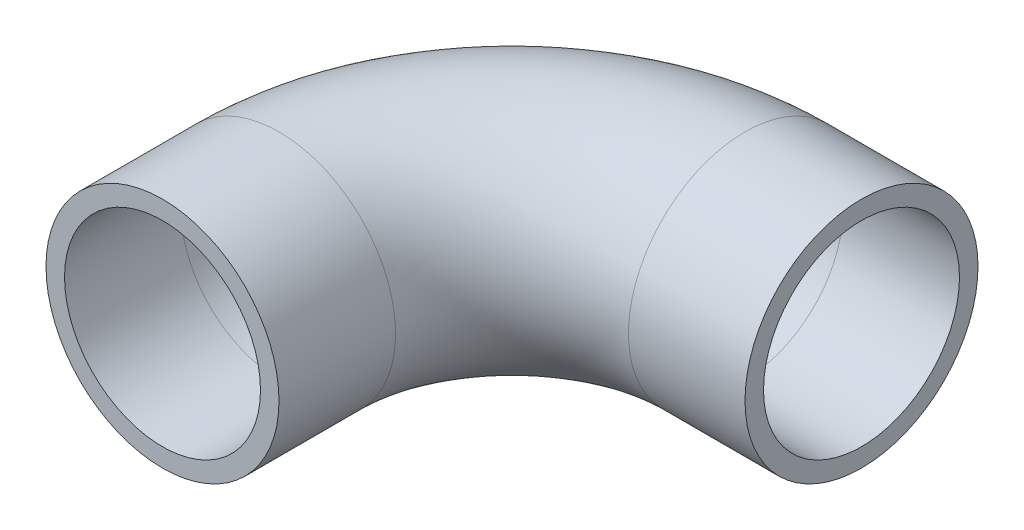
ISO-10303-21;
HEADER;
FILE_DESCRIPTION(('STEP AP214'),'2;1');
FILE_NAME('part.step','',(''),(''),'','','');
FILE_SCHEMA(('AUTOMOTIVE_DESIGN { 1 0 10303 214 1 1 1 1 }'));
ENDSEC;
DATA;
#1=APPLICATION_CONTEXT('core data for automotive mechanical design processes');
#2=APPLICATION_PROTOCOL_DEFINITION('international standard','automotive_design',2000,#1);
#3=PRODUCT_CONTEXT('',#1,'mechanical');
#4=PRODUCT('Part','Part','',(#3));
#5=PRODUCT_RELATED_PRODUCT_CATEGORY('part','',(#4));
#6=PRODUCT_DEFINITION_FORMATION('','',#4);
#7=PRODUCT_DEFINITION_CONTEXT('part definition',#1,'design');
#8=PRODUCT_DEFINITION('design','',#6,#7);
#9=PRODUCT_DEFINITION_SHAPE('','',#8);
#10=(LENGTH_UNIT() NAMED_UNIT(*) SI_UNIT(.MILLI.,.METRE.));
#11=(NAMED_UNIT(*) PLANE_ANGLE_UNIT() SI_UNIT($,.RADIAN.));
#12=(NAMED_UNIT(*) SI_UNIT($,.STERADIAN.) SOLID_ANGLE_UNIT());
#13=UNCERTAINTY_MEASURE_WITH_UNIT(LENGTH_MEASURE(1.E-05),#10,'distance_accuracy_value','');
#14=(GEOMETRIC_REPRESENTATION_CONTEXT(3) GLOBAL_UNCERTAINTY_ASSIGNED_CONTEXT((#13)) GLOBAL_UNIT_ASSIGNED_CONTEXT((#10,
#11,#12)) REPRESENTATION_CONTEXT('',''));
#15=CARTESIAN_POINT('',(0.,0.,0.));
#16=DIRECTION('',(0.,0.,1.));
#17=DIRECTION('',(1.,0.,0.));
#18=AXIS2_PLACEMENT_3D('',#15,#16,#17);
#19=CARTESIAN_POINT('',(0.,0.,0.));
#20=DIRECTION('',(0.,0.,-1.));
#21=DIRECTION('',(-1.,0.,0.));
#22=AXIS2_PLACEMENT_3D('',#19,#20,#21);
#23=CYLINDRICAL_SURFACE('',#22,12.7);
#24=CARTESIAN_POINT('',(0.,0.,-12.7));
#25=DIRECTION('',(0.,0.,1.));
#26=DIRECTION('',(1.,0.,0.));
#27=AXIS2_PLACEMENT_3D('',#24,#25,#26);
#28=CIRCLE('',#27,12.7);
#29=CARTESIAN_POINT('',(-12.7,0.,-12.7));
#30=VERTEX_POINT('',#29);
#31=EDGE_CURVE('E99',#30,#30,#28,.T.);
#32=ORIENTED_EDGE('',*,*,#31,.T.);
#33=EDGE_LOOP('',(#32));
#34=FACE_BOUND('',#33,.T.);
#35=CARTESIAN_POINT('',(0.,0.,0.));
#36=DIRECTION('',(0.,0.,1.));
#37=DIRECTION('',(1.,0.,0.));
#38=AXIS2_PLACEMENT_3D('',#35,#36,#37);
#39=CIRCLE('',#38,12.7);
#40=CARTESIAN_POINT('',(12.7,0.,0.));
#41=VERTEX_POINT('',#40);
#42=EDGE_CURVE('E48',#41,#41,#39,.T.);
#43=ORIENTED_EDGE('',*,*,#42,.F.);
#44=EDGE_LOOP('',(#43));
#45=FACE_BOUND('',#44,.T.);
#46=ADVANCED_FACE('F33',(#34,#45),#23,.T.);
#47=CARTESIAN_POINT('',(25.4,0.,-12.7));
#48=DIRECTION('',(0.,-1.,0.));
#49=DIRECTION('',(0.,0.,-1.));
#50=AXIS2_PLACEMENT_3D('',#47,#48,#49);
#51=TOROIDAL_SURFACE('',#50,25.4,12.7);
#52=CARTESIAN_POINT('',(25.4,0.,-38.1));
#53=DIRECTION('',(-1.,0.,0.));
#54=DIRECTION('',(0.,0.,1.));
#55=AXIS2_PLACEMENT_3D('',#52,#53,#54);
#56=CIRCLE('',#55,12.7);
#57=CARTESIAN_POINT('',(25.4,0.,-50.8));
#58=VERTEX_POINT('',#57);
#59=EDGE_CURVE('E37',#58,#58,#56,.T.);
#60=CARTESIAN_POINT('',(25.4,0.,-12.7));
#61=DIRECTION('',(0.,-1.,0.));
#62=DIRECTION('',(0.,0.,-1.));
#63=AXIS2_PLACEMENT_3D('',#60,#61,#62);
#64=CIRCLE('',#63,38.1);
#65=EDGE_CURVE('',#30,#58,#64,.T.);
#66=ORIENTED_EDGE('',*,*,#31,.F.);
#67=ORIENTED_EDGE('',*,*,#59,.T.);
#68=ORIENTED_EDGE('',*,*,#65,.T.);
#69=ORIENTED_EDGE('',*,*,#65,.F.);
#70=EDGE_LOOP('',(#66,#68,#67,#69));
#71=FACE_BOUND('',#70,.T.);
#72=ADVANCED_FACE('F106',(#71),#51,.T.);
#73=CARTESIAN_POINT('',(25.4,0.,-38.1));
#74=DIRECTION('',(1.,0.,0.));
#75=DIRECTION('',(0.,0.,-1.));
#76=AXIS2_PLACEMENT_3D('',#73,#74,#75);
#77=CYLINDRICAL_SURFACE('',#76,12.7);
#78=CARTESIAN_POINT('',(38.1,0.,-38.1));
#79=DIRECTION('',(-1.,0.,0.));
#80=DIRECTION('',(0.,0.,1.));
#81=AXIS2_PLACEMENT_3D('',#78,#79,#80);
#82=CIRCLE('',#81,12.7);
#83=CARTESIAN_POINT('',(38.1,0.,-25.4));
#84=VERTEX_POINT('',#83);
#85=EDGE_CURVE('E53',#84,#84,#82,.T.);
#86=ORIENTED_EDGE('',*,*,#85,.T.);
#87=EDGE_LOOP('',(#86));
#88=FACE_BOUND('',#87,.T.);
#89=ORIENTED_EDGE('',*,*,#59,.F.);
#90=EDGE_LOOP('',(#89));
#91=FACE_BOUND('',#90,.T.);
#92=ADVANCED_FACE('F35',(#88,#91),#77,.T.);
#93=CARTESIAN_POINT('',(0.,0.,0.));
#94=DIRECTION('',(0.,0.,1.));
#95=DIRECTION('',(1.,0.,0.));
#96=AXIS2_PLACEMENT_3D('',#93,#94,#95);
#97=PLANE('',#96);
#98=CARTESIAN_POINT('',(0.,0.,0.));
#99=DIRECTION('',(0.,0.,1.));
#100=DIRECTION('',(1.,0.,0.));
#101=AXIS2_PLACEMENT_3D('',#98,#99,#100);
#102=CIRCLE('',#101,10.6807);
#103=CARTESIAN_POINT('',(10.6807,0.,0.));
#104=VERTEX_POINT('',#103);
#105=EDGE_CURVE('E92',#104,#104,#102,.F.);
#106=ORIENTED_EDGE('',*,*,#105,.T.);
#107=EDGE_LOOP('',(#106));
#108=FACE_BOUND('',#107,.T.);
#109=ORIENTED_EDGE('',*,*,#42,.T.);
#110=EDGE_LOOP('',(#109));
#111=FACE_BOUND('',#110,.T.);
#112=ADVANCED_FACE('F66',(#108,#111),#97,.T.);
#113=CARTESIAN_POINT('',(38.1,0.,-38.1));
#114=DIRECTION('',(-1.,0.,0.));
#115=DIRECTION('',(0.,0.,1.));
#116=AXIS2_PLACEMENT_3D('',#113,#114,#115);
#117=PLANE('',#116);
#118=CARTESIAN_POINT('',(38.1,0.,-38.1));
#119=DIRECTION('',(-1.,0.,0.));
#120=DIRECTION('',(0.,0.,1.));
#121=AXIS2_PLACEMENT_3D('',#118,#119,#120);
#122=CIRCLE('',#121,10.6807);
#123=CARTESIAN_POINT('',(38.1,0.,-27.4193));
#124=VERTEX_POINT('',#123);
#125=EDGE_CURVE('E11',#124,#124,#122,.F.);
#126=ORIENTED_EDGE('',*,*,#125,.F.);
#127=EDGE_LOOP('',(#126));
#128=FACE_BOUND('',#127,.T.);
#129=ORIENTED_EDGE('',*,*,#85,.F.);
#130=EDGE_LOOP('',(#129));
#131=FACE_BOUND('',#130,.T.);
#132=ADVANCED_FACE('F63',(#128,#131),#117,.F.);
#133=CARTESIAN_POINT('',(0.,0.,0.));
#134=DIRECTION('',(0.,0.,-1.));
#135=DIRECTION('',(-1.,0.,0.));
#136=AXIS2_PLACEMENT_3D('',#133,#134,#135);
#137=CYLINDRICAL_SURFACE('',#136,10.6807);
#138=CARTESIAN_POINT('',(0.,0.,-12.7));
#139=DIRECTION('',(0.,0.,1.));
#140=DIRECTION('',(1.,0.,0.));
#141=AXIS2_PLACEMENT_3D('',#138,#139,#140);
#142=CIRCLE('',#141,10.6807);
#143=CARTESIAN_POINT('',(-10.6807,0.,-12.7));
#144=VERTEX_POINT('',#143);
#145=EDGE_CURVE('E91',#144,#144,#142,.F.);
#146=ORIENTED_EDGE('',*,*,#145,.T.);
#147=EDGE_LOOP('',(#146));
#148=FACE_BOUND('',#147,.T.);
#149=ORIENTED_EDGE('',*,*,#105,.F.);
#150=EDGE_LOOP('',(#149));
#151=FACE_BOUND('',#150,.T.);
#152=ADVANCED_FACE('F65',(#148,#151),#137,.F.);
#153=CARTESIAN_POINT('',(25.4,0.,-12.7));
#154=DIRECTION('',(0.,-1.,0.));
#155=DIRECTION('',(0.,0.,-1.));
#156=AXIS2_PLACEMENT_3D('',#153,#154,#155);
#157=TOROIDAL_SURFACE('',#156,25.4,10.6807);
#158=CARTESIAN_POINT('',(25.4,0.,-38.1));
#159=DIRECTION('',(-1.,0.,0.));
#160=DIRECTION('',(0.,0.,1.));
#161=AXIS2_PLACEMENT_3D('',#158,#159,#160);
#162=CIRCLE('',#161,10.6807);
#163=CARTESIAN_POINT('',(25.4,0.,-48.7807));
#164=VERTEX_POINT('',#163);
#165=EDGE_CURVE('E42',#164,#164,#162,.F.);
#166=CARTESIAN_POINT('',(25.4,0.,-12.7));
#167=DIRECTION('',(0.,-1.,0.));
#168=DIRECTION('',(0.,0.,-1.));
#169=AXIS2_PLACEMENT_3D('',#166,#167,#168);
#170=CIRCLE('',#169,36.0807);
#171=EDGE_CURVE('',#144,#164,#170,.T.);
#172=ORIENTED_EDGE('',*,*,#145,.F.);
#173=ORIENTED_EDGE('',*,*,#165,.T.);
#174=ORIENTED_EDGE('',*,*,#171,.T.);
#175=ORIENTED_EDGE('',*,*,#171,.F.);
#176=EDGE_LOOP('',(#172,#174,#173,#175));
#177=FACE_BOUND('',#176,.T.);
#178=ADVANCED_FACE('F72',(#177),#157,.F.);
#179=CARTESIAN_POINT('',(25.4,0.,-38.1));
#180=DIRECTION('',(1.,0.,0.));
#181=DIRECTION('',(0.,0.,-1.));
#182=AXIS2_PLACEMENT_3D('',#179,#180,#181);
#183=CYLINDRICAL_SURFACE('',#182,10.6807);
#184=ORIENTED_EDGE('',*,*,#125,.T.);
#185=EDGE_LOOP('',(#184));
#186=FACE_BOUND('',#185,.T.);
#187=ORIENTED_EDGE('',*,*,#165,.F.);
#188=EDGE_LOOP('',(#187));
#189=FACE_BOUND('',#188,.T.);
#190=ADVANCED_FACE('F60',(#186,#189),#183,.F.);
#191=CLOSED_SHELL('',(#46,#72,#92,#112,#132,#152,#178,#190));
#192=MANIFOLD_SOLID_BREP('B2',#191);
#193=ADVANCED_BREP_SHAPE_REPRESENTATION('',(#18,#192),#14);
#194=SHAPE_DEFINITION_REPRESENTATION(#9,#193);
ENDSEC;
END-ISO-10303-21;
